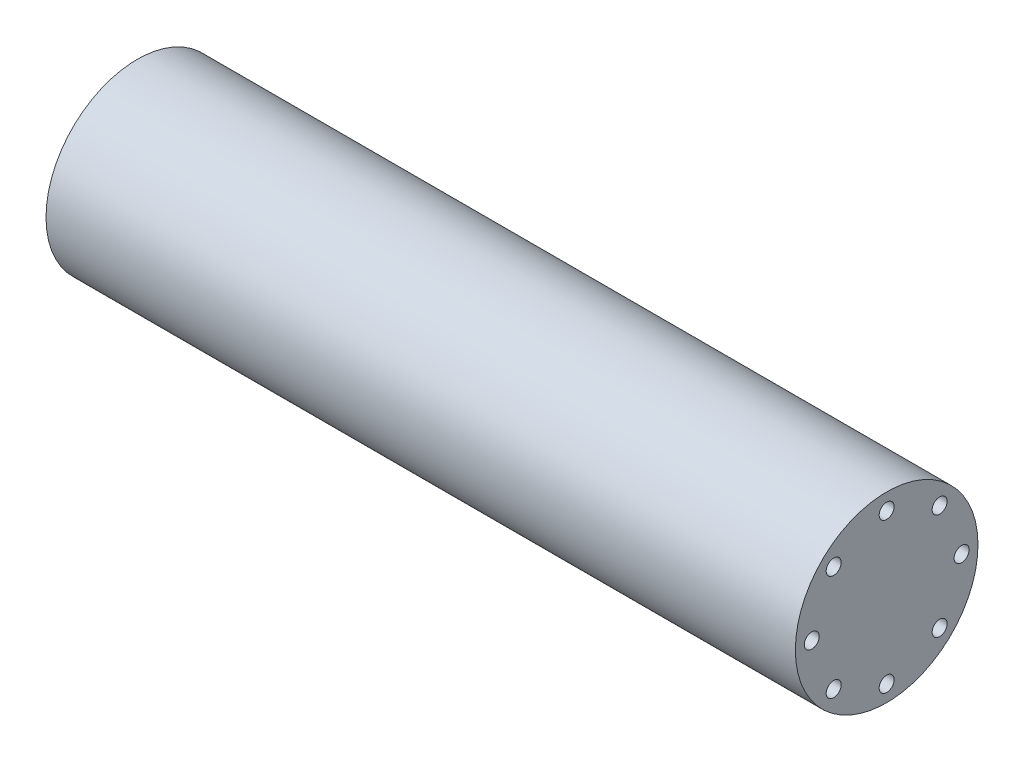
ISO-10303-21;
HEADER;
FILE_DESCRIPTION(('STEP AP214'),'2;1');
FILE_NAME('part.step','',(''),(''),'','','');
FILE_SCHEMA(('AUTOMOTIVE_DESIGN { 1 0 10303 214 1 1 1 1 }'));
ENDSEC;
DATA;
#1=APPLICATION_CONTEXT('core data for automotive mechanical design processes');
#2=APPLICATION_PROTOCOL_DEFINITION('international standard','automotive_design',2000,#1);
#3=PRODUCT_CONTEXT('',#1,'mechanical');
#4=PRODUCT('Part','Part','',(#3));
#5=PRODUCT_RELATED_PRODUCT_CATEGORY('part','',(#4));
#6=PRODUCT_DEFINITION_FORMATION('','',#4);
#7=PRODUCT_DEFINITION_CONTEXT('part definition',#1,'design');
#8=PRODUCT_DEFINITION('design','',#6,#7);
#9=PRODUCT_DEFINITION_SHAPE('','',#8);
#10=(LENGTH_UNIT() NAMED_UNIT(*) SI_UNIT(.MILLI.,.METRE.));
#11=(NAMED_UNIT(*) PLANE_ANGLE_UNIT() SI_UNIT($,.RADIAN.));
#12=(NAMED_UNIT(*) SI_UNIT($,.STERADIAN.) SOLID_ANGLE_UNIT());
#13=UNCERTAINTY_MEASURE_WITH_UNIT(LENGTH_MEASURE(1.E-05),#10,'distance_accuracy_value','');
#14=(GEOMETRIC_REPRESENTATION_CONTEXT(3) GLOBAL_UNCERTAINTY_ASSIGNED_CONTEXT((#13)) GLOBAL_UNIT_ASSIGNED_CONTEXT((#10,
#11,#12)) REPRESENTATION_CONTEXT('',''));
#15=CARTESIAN_POINT('',(0.,0.,0.));
#16=DIRECTION('',(0.,0.,1.));
#17=DIRECTION('',(1.,0.,0.));
#18=AXIS2_PLACEMENT_3D('',#15,#16,#17);
#19=CARTESIAN_POINT('',(80.,0.,0.));
#20=DIRECTION('',(-1.,0.,0.));
#21=DIRECTION('',(0.,0.,1.));
#22=AXIS2_PLACEMENT_3D('',#19,#20,#21);
#23=CYLINDRICAL_SURFACE('',#22,9.75);
#24=CARTESIAN_POINT('',(80.,0.,0.));
#25=DIRECTION('',(-1.,0.,0.));
#26=DIRECTION('',(0.,0.,1.));
#27=AXIS2_PLACEMENT_3D('',#24,#25,#26);
#28=CIRCLE('',#27,9.75);
#29=CARTESIAN_POINT('',(80.,0.,9.75));
#30=VERTEX_POINT('',#29);
#31=EDGE_CURVE('E11',#30,#30,#28,.T.);
#32=ORIENTED_EDGE('',*,*,#31,.T.);
#33=EDGE_LOOP('',(#32));
#34=FACE_BOUND('',#33,.T.);
#35=CARTESIAN_POINT('',(0.,0.,0.));
#36=DIRECTION('',(-1.,0.,0.));
#37=DIRECTION('',(0.,0.,1.));
#38=AXIS2_PLACEMENT_3D('',#35,#36,#37);
#39=CIRCLE('',#38,9.75);
#40=CARTESIAN_POINT('',(0.,0.,9.75));
#41=VERTEX_POINT('',#40);
#42=EDGE_CURVE('E40',#41,#41,#39,.T.);
#43=ORIENTED_EDGE('',*,*,#42,.F.);
#44=EDGE_LOOP('',(#43));
#45=FACE_BOUND('',#44,.T.);
#46=ADVANCED_FACE('F33',(#34,#45),#23,.T.);
#47=CARTESIAN_POINT('',(80.,9.75,0.));
#48=DIRECTION('',(1.,0.,0.));
#49=DIRECTION('',(0.,0.,-1.));
#50=AXIS2_PLACEMENT_3D('',#47,#48,#49);
#51=PLANE('',#50);
#52=CARTESIAN_POINT('',(80.,8.,0.));
#53=DIRECTION('',(1.,0.,0.));
#54=DIRECTION('',(0.,0.,-1.));
#55=AXIS2_PLACEMENT_3D('',#52,#53,#54);
#56=CIRCLE('',#55,0.799999999999986);
#57=CARTESIAN_POINT('',(80.,8.,-0.799999999999986));
#58=VERTEX_POINT('',#57);
#59=EDGE_CURVE('E100',#58,#58,#56,.T.);
#60=ORIENTED_EDGE('',*,*,#59,.F.);
#61=EDGE_LOOP('',(#60));
#62=FACE_BOUND('',#61,.T.);
#63=CARTESIAN_POINT('',(80.,5.65685424949262,-5.65685424949248));
#64=DIRECTION('',(1.,0.,0.));
#65=DIRECTION('',(0.,0.,-1.));
#66=AXIS2_PLACEMENT_3D('',#63,#64,#65);
#67=CIRCLE('',#66,0.799999999999986);
#68=CARTESIAN_POINT('',(80.,5.65685424949262,-6.45685424949247));
#69=VERTEX_POINT('',#68);
#70=EDGE_CURVE('E99',#69,#69,#67,.T.);
#71=ORIENTED_EDGE('',*,*,#70,.F.);
#72=EDGE_LOOP('',(#71));
#73=FACE_BOUND('',#72,.T.);
#74=CARTESIAN_POINT('',(80.,3.4008079572553E-13,-8.00000000000034));
#75=DIRECTION('',(1.,0.,0.));
#76=DIRECTION('',(0.,0.,-1.));
#77=AXIS2_PLACEMENT_3D('',#74,#75,#76);
#78=CIRCLE('',#77,0.799999999999986);
#79=CARTESIAN_POINT('',(80.,3.4008079572553E-13,-8.80000000000033));
#80=VERTEX_POINT('',#79);
#81=EDGE_CURVE('E110',#80,#80,#78,.T.);
#82=ORIENTED_EDGE('',*,*,#81,.F.);
#83=EDGE_LOOP('',(#82));
#84=FACE_BOUND('',#83,.T.);
#85=CARTESIAN_POINT('',(80.,-5.65685424949214,-5.65685424949296));
#86=DIRECTION('',(1.,0.,0.));
#87=DIRECTION('',(0.,0.,-1.));
#88=AXIS2_PLACEMENT_3D('',#85,#86,#87);
#89=CIRCLE('',#88,0.799999999999986);
#90=CARTESIAN_POINT('',(80.,-5.65685424949214,-6.45685424949295));
#91=VERTEX_POINT('',#90);
#92=EDGE_CURVE('E116',#91,#91,#89,.T.);
#93=ORIENTED_EDGE('',*,*,#92,.F.);
#94=EDGE_LOOP('',(#93));
#95=FACE_BOUND('',#94,.T.);
#96=CARTESIAN_POINT('',(80.,-8.,-6.8016159145106E-13));
#97=DIRECTION('',(1.,0.,0.));
#98=DIRECTION('',(0.,0.,-1.));
#99=AXIS2_PLACEMENT_3D('',#96,#97,#98);
#100=CIRCLE('',#99,0.799999999999986);
#101=CARTESIAN_POINT('',(80.,-8.,-0.800000000000667));
#102=VERTEX_POINT('',#101);
#103=EDGE_CURVE('E122',#102,#102,#100,.T.);
#104=ORIENTED_EDGE('',*,*,#103,.F.);
#105=EDGE_LOOP('',(#104));
#106=FACE_BOUND('',#105,.T.);
#107=CARTESIAN_POINT('',(80.,-5.65685424949262,5.6568542494918));
#108=DIRECTION('',(1.,0.,0.));
#109=DIRECTION('',(0.,0.,-1.));
#110=AXIS2_PLACEMENT_3D('',#107,#108,#109);
#111=CIRCLE('',#110,0.799999999999986);
#112=CARTESIAN_POINT('',(80.,-5.65685424949262,4.85685424949181));
#113=VERTEX_POINT('',#112);
#114=EDGE_CURVE('E128',#113,#113,#111,.T.);
#115=ORIENTED_EDGE('',*,*,#114,.F.);
#116=EDGE_LOOP('',(#115));
#117=FACE_BOUND('',#116,.T.);
#118=CARTESIAN_POINT('',(80.,-3.41060513164848E-13,7.99999999999966));
#119=DIRECTION('',(1.,0.,0.));
#120=DIRECTION('',(0.,0.,-1.));
#121=AXIS2_PLACEMENT_3D('',#118,#119,#120);
#122=CIRCLE('',#121,0.799999999999986);
#123=CARTESIAN_POINT('',(80.,-3.41060513164848E-13,7.19999999999967));
#124=VERTEX_POINT('',#123);
#125=EDGE_CURVE('E134',#124,#124,#122,.T.);
#126=ORIENTED_EDGE('',*,*,#125,.F.);
#127=EDGE_LOOP('',(#126));
#128=FACE_BOUND('',#127,.T.);
#129=CARTESIAN_POINT('',(80.,5.65685424949214,5.65685424949228));
#130=DIRECTION('',(1.,0.,0.));
#131=DIRECTION('',(0.,0.,-1.));
#132=AXIS2_PLACEMENT_3D('',#129,#130,#131);
#133=CIRCLE('',#132,0.799999999999986);
#134=CARTESIAN_POINT('',(80.,5.65685424949214,4.85685424949229));
#135=VERTEX_POINT('',#134);
#136=EDGE_CURVE('E140',#135,#135,#133,.T.);
#137=ORIENTED_EDGE('',*,*,#136,.F.);
#138=EDGE_LOOP('',(#137));
#139=FACE_BOUND('',#138,.T.);
#140=ORIENTED_EDGE('',*,*,#31,.F.);
#141=EDGE_LOOP('',(#140));
#142=FACE_BOUND('',#141,.T.);
#143=ADVANCED_FACE('F199',(#62,#73,#84,#95,#106,#117,#128,#139,#142),#51,.T.);
#144=CARTESIAN_POINT('',(0.,0.,0.));
#145=DIRECTION('',(-1.,0.,0.));
#146=DIRECTION('',(0.,0.,1.));
#147=AXIS2_PLACEMENT_3D('',#144,#145,#146);
#148=PLANE('',#147);
#149=CARTESIAN_POINT('',(0.,8.,0.));
#150=DIRECTION('',(-1.,0.,0.));
#151=DIRECTION('',(0.,0.,1.));
#152=AXIS2_PLACEMENT_3D('',#149,#150,#151);
#153=CIRCLE('',#152,0.799999999999986);
#154=CARTESIAN_POINT('',(0.,8.,0.799999999999986));
#155=VERTEX_POINT('',#154);
#156=EDGE_CURVE('E146',#155,#155,#153,.T.);
#157=ORIENTED_EDGE('',*,*,#156,.F.);
#158=EDGE_LOOP('',(#157));
#159=FACE_BOUND('',#158,.T.);
#160=CARTESIAN_POINT('',(0.,5.65685424949262,-5.65685424949248));
#161=DIRECTION('',(-1.,0.,0.));
#162=DIRECTION('',(0.,0.,1.));
#163=AXIS2_PLACEMENT_3D('',#160,#161,#162);
#164=CIRCLE('',#163,0.799999999999986);
#165=CARTESIAN_POINT('',(0.,5.65685424949262,-4.85685424949249));
#166=VERTEX_POINT('',#165);
#167=EDGE_CURVE('E152',#166,#166,#164,.T.);
#168=ORIENTED_EDGE('',*,*,#167,.F.);
#169=EDGE_LOOP('',(#168));
#170=FACE_BOUND('',#169,.T.);
#171=CARTESIAN_POINT('',(0.,3.4008079572553E-13,-8.00000000000034));
#172=DIRECTION('',(-1.,0.,0.));
#173=DIRECTION('',(0.,0.,1.));
#174=AXIS2_PLACEMENT_3D('',#171,#172,#173);
#175=CIRCLE('',#174,0.799999999999986);
#176=CARTESIAN_POINT('',(0.,3.4008079572553E-13,-7.20000000000036));
#177=VERTEX_POINT('',#176);
#178=EDGE_CURVE('E158',#177,#177,#175,.T.);
#179=ORIENTED_EDGE('',*,*,#178,.F.);
#180=EDGE_LOOP('',(#179));
#181=FACE_BOUND('',#180,.T.);
#182=CARTESIAN_POINT('',(0.,-5.65685424949214,-5.65685424949296));
#183=DIRECTION('',(-1.,0.,0.));
#184=DIRECTION('',(0.,0.,1.));
#185=AXIS2_PLACEMENT_3D('',#182,#183,#184);
#186=CIRCLE('',#185,0.799999999999986);
#187=CARTESIAN_POINT('',(0.,-5.65685424949214,-4.85685424949297));
#188=VERTEX_POINT('',#187);
#189=EDGE_CURVE('E164',#188,#188,#186,.T.);
#190=ORIENTED_EDGE('',*,*,#189,.F.);
#191=EDGE_LOOP('',(#190));
#192=FACE_BOUND('',#191,.T.);
#193=CARTESIAN_POINT('',(0.,-8.,-6.8016159145106E-13));
#194=DIRECTION('',(-1.,0.,0.));
#195=DIRECTION('',(0.,0.,1.));
#196=AXIS2_PLACEMENT_3D('',#193,#194,#195);
#197=CIRCLE('',#196,0.799999999999986);
#198=CARTESIAN_POINT('',(0.,-8.,0.799999999999306));
#199=VERTEX_POINT('',#198);
#200=EDGE_CURVE('E170',#199,#199,#197,.T.);
#201=ORIENTED_EDGE('',*,*,#200,.F.);
#202=EDGE_LOOP('',(#201));
#203=FACE_BOUND('',#202,.T.);
#204=CARTESIAN_POINT('',(0.,-5.65685424949262,5.6568542494918));
#205=DIRECTION('',(-1.,0.,0.));
#206=DIRECTION('',(0.,0.,1.));
#207=AXIS2_PLACEMENT_3D('',#204,#205,#206);
#208=CIRCLE('',#207,0.799999999999986);
#209=CARTESIAN_POINT('',(0.,-5.65685424949262,6.45685424949179));
#210=VERTEX_POINT('',#209);
#211=EDGE_CURVE('E176',#210,#210,#208,.T.);
#212=ORIENTED_EDGE('',*,*,#211,.F.);
#213=EDGE_LOOP('',(#212));
#214=FACE_BOUND('',#213,.T.);
#215=CARTESIAN_POINT('',(0.,-3.41060513164848E-13,7.99999999999966));
#216=DIRECTION('',(-1.,0.,0.));
#217=DIRECTION('',(0.,0.,1.));
#218=AXIS2_PLACEMENT_3D('',#215,#216,#217);
#219=CIRCLE('',#218,0.799999999999986);
#220=CARTESIAN_POINT('',(0.,-3.41060513164848E-13,8.79999999999965));
#221=VERTEX_POINT('',#220);
#222=EDGE_CURVE('E182',#221,#221,#219,.T.);
#223=ORIENTED_EDGE('',*,*,#222,.F.);
#224=EDGE_LOOP('',(#223));
#225=FACE_BOUND('',#224,.T.);
#226=CARTESIAN_POINT('',(0.,5.65685424949214,5.65685424949228));
#227=DIRECTION('',(-1.,0.,0.));
#228=DIRECTION('',(0.,0.,1.));
#229=AXIS2_PLACEMENT_3D('',#226,#227,#228);
#230=CIRCLE('',#229,0.799999999999986);
#231=CARTESIAN_POINT('',(0.,5.65685424949214,6.45685424949227));
#232=VERTEX_POINT('',#231);
#233=EDGE_CURVE('E188',#232,#232,#230,.T.);
#234=ORIENTED_EDGE('',*,*,#233,.F.);
#235=EDGE_LOOP('',(#234));
#236=FACE_BOUND('',#235,.T.);
#237=ORIENTED_EDGE('',*,*,#42,.T.);
#238=EDGE_LOOP('',(#237));
#239=FACE_BOUND('',#238,.T.);
#240=ADVANCED_FACE('F196',(#159,#170,#181,#192,#203,#214,#225,#236,#239),#148,.T.);
#241=CARTESIAN_POINT('',(15.2,5.65685424949214,5.65685424949228));
#242=DIRECTION('',(-1.,0.,0.));
#243=DIRECTION('',(0.,0.,1.));
#244=AXIS2_PLACEMENT_3D('',#241,#242,#243);
#245=CONICAL_SURFACE('',#244,0.799999999999985,1.02974425859498);
#246=CARTESIAN_POINT('',(15.680688495311,5.65685424949214,5.65685424949228));
#247=VERTEX_POINT('',#246);
#248=VERTEX_LOOP('',#247);
#249=FACE_BOUND('',#248,.T.);
#250=CARTESIAN_POINT('',(15.2,5.65685424949214,5.65685424949228));
#251=DIRECTION('',(-1.,0.,0.));
#252=DIRECTION('',(0.,0.,1.));
#253=AXIS2_PLACEMENT_3D('',#250,#251,#252);
#254=CIRCLE('',#253,0.799999999999985);
#255=CARTESIAN_POINT('',(15.2,5.65685424949214,6.45685424949227));
#256=VERTEX_POINT('',#255);
#257=EDGE_CURVE('E191',#256,#256,#254,.T.);
#258=ORIENTED_EDGE('',*,*,#257,.T.);
#259=EDGE_LOOP('',(#258));
#260=FACE_BOUND('',#259,.T.);
#261=ADVANCED_FACE('F210',(#249,#260),#245,.F.);
#262=CARTESIAN_POINT('',(0.,5.65685424949214,5.65685424949228));
#263=DIRECTION('',(-1.,0.,0.));
#264=DIRECTION('',(0.,0.,1.));
#265=AXIS2_PLACEMENT_3D('',#262,#263,#264);
#266=CYLINDRICAL_SURFACE('',#265,0.799999999999986);
#267=ORIENTED_EDGE('',*,*,#257,.F.);
#268=EDGE_LOOP('',(#267));
#269=FACE_BOUND('',#268,.T.);
#270=ORIENTED_EDGE('',*,*,#233,.T.);
#271=EDGE_LOOP('',(#270));
#272=FACE_BOUND('',#271,.T.);
#273=ADVANCED_FACE('F218',(#269,#272),#266,.F.);
#274=CARTESIAN_POINT('',(15.2,-3.41060513164848E-13,7.99999999999966));
#275=DIRECTION('',(-1.,0.,0.));
#276=DIRECTION('',(0.,0.,1.));
#277=AXIS2_PLACEMENT_3D('',#274,#275,#276);
#278=CONICAL_SURFACE('',#277,0.799999999999985,1.02974425859498);
#279=CARTESIAN_POINT('',(15.680688495311,-3.45106817684485E-13,7.99999999999966));
#280=VERTEX_POINT('',#279);
#281=VERTEX_LOOP('',#280);
#282=FACE_BOUND('',#281,.T.);
#283=CARTESIAN_POINT('',(15.2,-3.41060513164848E-13,7.99999999999966));
#284=DIRECTION('',(-1.,0.,0.));
#285=DIRECTION('',(0.,0.,1.));
#286=AXIS2_PLACEMENT_3D('',#283,#284,#285);
#287=CIRCLE('',#286,0.799999999999985);
#288=CARTESIAN_POINT('',(15.2,-3.41060513164848E-13,8.79999999999965));
#289=VERTEX_POINT('',#288);
#290=EDGE_CURVE('E185',#289,#289,#287,.T.);
#291=ORIENTED_EDGE('',*,*,#290,.T.);
#292=EDGE_LOOP('',(#291));
#293=FACE_BOUND('',#292,.T.);
#294=ADVANCED_FACE('F221',(#282,#293),#278,.F.);
#295=CARTESIAN_POINT('',(0.,-3.41060513164848E-13,7.99999999999966));
#296=DIRECTION('',(-1.,0.,0.));
#297=DIRECTION('',(0.,0.,1.));
#298=AXIS2_PLACEMENT_3D('',#295,#296,#297);
#299=CYLINDRICAL_SURFACE('',#298,0.799999999999986);
#300=ORIENTED_EDGE('',*,*,#290,.F.);
#301=EDGE_LOOP('',(#300));
#302=FACE_BOUND('',#301,.T.);
#303=ORIENTED_EDGE('',*,*,#222,.T.);
#304=EDGE_LOOP('',(#303));
#305=FACE_BOUND('',#304,.T.);
#306=ADVANCED_FACE('F225',(#302,#305),#299,.F.);
#307=CARTESIAN_POINT('',(15.2,-5.65685424949262,5.6568542494918));
#308=DIRECTION('',(-1.,0.,0.));
#309=DIRECTION('',(0.,0.,1.));
#310=AXIS2_PLACEMENT_3D('',#307,#308,#309);
#311=CONICAL_SURFACE('',#310,0.799999999999985,1.02974425859498);
#312=CARTESIAN_POINT('',(15.680688495311,-5.65685424949263,5.6568542494918));
#313=VERTEX_POINT('',#312);
#314=VERTEX_LOOP('',#313);
#315=FACE_BOUND('',#314,.T.);
#316=CARTESIAN_POINT('',(15.2,-5.65685424949262,5.6568542494918));
#317=DIRECTION('',(-1.,0.,0.));
#318=DIRECTION('',(0.,0.,1.));
#319=AXIS2_PLACEMENT_3D('',#316,#317,#318);
#320=CIRCLE('',#319,0.799999999999985);
#321=CARTESIAN_POINT('',(15.2,-5.65685424949262,6.45685424949179));
#322=VERTEX_POINT('',#321);
#323=EDGE_CURVE('E179',#322,#322,#320,.T.);
#324=ORIENTED_EDGE('',*,*,#323,.T.);
#325=EDGE_LOOP('',(#324));
#326=FACE_BOUND('',#325,.T.);
#327=ADVANCED_FACE('F228',(#315,#326),#311,.F.);
#328=CARTESIAN_POINT('',(0.,-5.65685424949262,5.6568542494918));
#329=DIRECTION('',(-1.,0.,0.));
#330=DIRECTION('',(0.,0.,1.));
#331=AXIS2_PLACEMENT_3D('',#328,#329,#330);
#332=CYLINDRICAL_SURFACE('',#331,0.799999999999986);
#333=ORIENTED_EDGE('',*,*,#323,.F.);
#334=EDGE_LOOP('',(#333));
#335=FACE_BOUND('',#334,.T.);
#336=ORIENTED_EDGE('',*,*,#211,.T.);
#337=EDGE_LOOP('',(#336));
#338=FACE_BOUND('',#337,.T.);
#339=ADVANCED_FACE('F232',(#335,#338),#332,.F.);
#340=CARTESIAN_POINT('',(15.2,-8.,-6.8016159145106E-13));
#341=DIRECTION('',(-1.,0.,0.));
#342=DIRECTION('',(0.,0.,1.));
#343=AXIS2_PLACEMENT_3D('',#340,#341,#342);
#344=CONICAL_SURFACE('',#343,0.799999999999985,1.02974425859498);
#345=CARTESIAN_POINT('',(15.680688495311,-8.,-6.8016159145106E-13));
#346=VERTEX_POINT('',#345);
#347=VERTEX_LOOP('',#346);
#348=FACE_BOUND('',#347,.T.);
#349=CARTESIAN_POINT('',(15.2,-8.,-6.8016159145106E-13));
#350=DIRECTION('',(-1.,0.,0.));
#351=DIRECTION('',(0.,0.,1.));
#352=AXIS2_PLACEMENT_3D('',#349,#350,#351);
#353=CIRCLE('',#352,0.799999999999985);
#354=CARTESIAN_POINT('',(15.2,-8.,0.799999999999305));
#355=VERTEX_POINT('',#354);
#356=EDGE_CURVE('E173',#355,#355,#353,.T.);
#357=ORIENTED_EDGE('',*,*,#356,.T.);
#358=EDGE_LOOP('',(#357));
#359=FACE_BOUND('',#358,.T.);
#360=ADVANCED_FACE('F236',(#348,#359),#344,.F.);
#361=CARTESIAN_POINT('',(0.,-8.,-6.8016159145106E-13));
#362=DIRECTION('',(-1.,0.,0.));
#363=DIRECTION('',(0.,0.,1.));
#364=AXIS2_PLACEMENT_3D('',#361,#362,#363);
#365=CYLINDRICAL_SURFACE('',#364,0.799999999999986);
#366=ORIENTED_EDGE('',*,*,#356,.F.);
#367=EDGE_LOOP('',(#366));
#368=FACE_BOUND('',#367,.T.);
#369=ORIENTED_EDGE('',*,*,#200,.T.);
#370=EDGE_LOOP('',(#369));
#371=FACE_BOUND('',#370,.T.);
#372=ADVANCED_FACE('F240',(#368,#371),#365,.F.);
#373=CARTESIAN_POINT('',(15.2,-5.65685424949214,-5.65685424949296));
#374=DIRECTION('',(-1.,0.,0.));
#375=DIRECTION('',(0.,0.,1.));
#376=AXIS2_PLACEMENT_3D('',#373,#374,#375);
#377=CONICAL_SURFACE('',#376,0.799999999999985,1.02974425859498);
#378=CARTESIAN_POINT('',(15.680688495311,-5.65685424949214,-5.65685424949296));
#379=VERTEX_POINT('',#378);
#380=VERTEX_LOOP('',#379);
#381=FACE_BOUND('',#380,.T.);
#382=CARTESIAN_POINT('',(15.2,-5.65685424949214,-5.65685424949296));
#383=DIRECTION('',(-1.,0.,0.));
#384=DIRECTION('',(0.,0.,1.));
#385=AXIS2_PLACEMENT_3D('',#382,#383,#384);
#386=CIRCLE('',#385,0.799999999999985);
#387=CARTESIAN_POINT('',(15.2,-5.65685424949214,-4.85685424949298));
#388=VERTEX_POINT('',#387);
#389=EDGE_CURVE('E167',#388,#388,#386,.T.);
#390=ORIENTED_EDGE('',*,*,#389,.T.);
#391=EDGE_LOOP('',(#390));
#392=FACE_BOUND('',#391,.T.);
#393=ADVANCED_FACE('F244',(#381,#392),#377,.F.);
#394=CARTESIAN_POINT('',(0.,-5.65685424949214,-5.65685424949296));
#395=DIRECTION('',(-1.,0.,0.));
#396=DIRECTION('',(0.,0.,1.));
#397=AXIS2_PLACEMENT_3D('',#394,#395,#396);
#398=CYLINDRICAL_SURFACE('',#397,0.799999999999986);
#399=ORIENTED_EDGE('',*,*,#389,.F.);
#400=EDGE_LOOP('',(#399));
#401=FACE_BOUND('',#400,.T.);
#402=ORIENTED_EDGE('',*,*,#189,.T.);
#403=EDGE_LOOP('',(#402));
#404=FACE_BOUND('',#403,.T.);
#405=ADVANCED_FACE('F248',(#401,#404),#398,.F.);
#406=CARTESIAN_POINT('',(15.2,3.4008079572553E-13,-8.00000000000034));
#407=DIRECTION('',(-1.,0.,0.));
#408=DIRECTION('',(0.,0.,1.));
#409=AXIS2_PLACEMENT_3D('',#406,#407,#408);
#410=CONICAL_SURFACE('',#409,0.799999999999985,1.02974425859498);
#411=CARTESIAN_POINT('',(15.680688495311,3.36034491205893E-13,-8.00000000000034));
#412=VERTEX_POINT('',#411);
#413=VERTEX_LOOP('',#412);
#414=FACE_BOUND('',#413,.T.);
#415=CARTESIAN_POINT('',(15.2,3.4008079572553E-13,-8.00000000000034));
#416=DIRECTION('',(-1.,0.,0.));
#417=DIRECTION('',(0.,0.,1.));
#418=AXIS2_PLACEMENT_3D('',#415,#416,#417);
#419=CIRCLE('',#418,0.799999999999985);
#420=CARTESIAN_POINT('',(15.2,3.4008079572553E-13,-7.20000000000036));
#421=VERTEX_POINT('',#420);
#422=EDGE_CURVE('E161',#421,#421,#419,.T.);
#423=ORIENTED_EDGE('',*,*,#422,.T.);
#424=EDGE_LOOP('',(#423));
#425=FACE_BOUND('',#424,.T.);
#426=ADVANCED_FACE('F252',(#414,#425),#410,.F.);
#427=CARTESIAN_POINT('',(0.,3.4008079572553E-13,-8.00000000000034));
#428=DIRECTION('',(-1.,0.,0.));
#429=DIRECTION('',(0.,0.,1.));
#430=AXIS2_PLACEMENT_3D('',#427,#428,#429);
#431=CYLINDRICAL_SURFACE('',#430,0.799999999999986);
#432=ORIENTED_EDGE('',*,*,#422,.F.);
#433=EDGE_LOOP('',(#432));
#434=FACE_BOUND('',#433,.T.);
#435=ORIENTED_EDGE('',*,*,#178,.T.);
#436=EDGE_LOOP('',(#435));
#437=FACE_BOUND('',#436,.T.);
#438=ADVANCED_FACE('F256',(#434,#437),#431,.F.);
#439=CARTESIAN_POINT('',(15.2,5.65685424949262,-5.65685424949248));
#440=DIRECTION('',(-1.,0.,0.));
#441=DIRECTION('',(0.,0.,1.));
#442=AXIS2_PLACEMENT_3D('',#439,#440,#441);
#443=CONICAL_SURFACE('',#442,0.799999999999985,1.02974425859498);
#444=CARTESIAN_POINT('',(15.680688495311,5.65685424949262,-5.65685424949248));
#445=VERTEX_POINT('',#444);
#446=VERTEX_LOOP('',#445);
#447=FACE_BOUND('',#446,.T.);
#448=CARTESIAN_POINT('',(15.2,5.65685424949262,-5.65685424949248));
#449=DIRECTION('',(-1.,0.,0.));
#450=DIRECTION('',(0.,0.,1.));
#451=AXIS2_PLACEMENT_3D('',#448,#449,#450);
#452=CIRCLE('',#451,0.799999999999985);
#453=CARTESIAN_POINT('',(15.2,5.65685424949262,-4.8568542494925));
#454=VERTEX_POINT('',#453);
#455=EDGE_CURVE('E155',#454,#454,#452,.T.);
#456=ORIENTED_EDGE('',*,*,#455,.T.);
#457=EDGE_LOOP('',(#456));
#458=FACE_BOUND('',#457,.T.);
#459=ADVANCED_FACE('F260',(#447,#458),#443,.F.);
#460=CARTESIAN_POINT('',(0.,5.65685424949262,-5.65685424949248));
#461=DIRECTION('',(-1.,0.,0.));
#462=DIRECTION('',(0.,0.,1.));
#463=AXIS2_PLACEMENT_3D('',#460,#461,#462);
#464=CYLINDRICAL_SURFACE('',#463,0.799999999999986);
#465=ORIENTED_EDGE('',*,*,#455,.F.);
#466=EDGE_LOOP('',(#465));
#467=FACE_BOUND('',#466,.T.);
#468=ORIENTED_EDGE('',*,*,#167,.T.);
#469=EDGE_LOOP('',(#468));
#470=FACE_BOUND('',#469,.T.);
#471=ADVANCED_FACE('F264',(#467,#470),#464,.F.);
#472=CARTESIAN_POINT('',(15.2,8.,0.));
#473=DIRECTION('',(-1.,0.,0.));
#474=DIRECTION('',(0.,0.,1.));
#475=AXIS2_PLACEMENT_3D('',#472,#473,#474);
#476=CONICAL_SURFACE('',#475,0.799999999999985,1.02974425859498);
#477=CARTESIAN_POINT('',(15.680688495311,8.,0.));
#478=VERTEX_POINT('',#477);
#479=VERTEX_LOOP('',#478);
#480=FACE_BOUND('',#479,.T.);
#481=CARTESIAN_POINT('',(15.2,8.,0.));
#482=DIRECTION('',(-1.,0.,0.));
#483=DIRECTION('',(0.,0.,1.));
#484=AXIS2_PLACEMENT_3D('',#481,#482,#483);
#485=CIRCLE('',#484,0.799999999999985);
#486=CARTESIAN_POINT('',(15.2,8.,0.799999999999985));
#487=VERTEX_POINT('',#486);
#488=EDGE_CURVE('E149',#487,#487,#485,.T.);
#489=ORIENTED_EDGE('',*,*,#488,.T.);
#490=EDGE_LOOP('',(#489));
#491=FACE_BOUND('',#490,.T.);
#492=ADVANCED_FACE('F268',(#480,#491),#476,.F.);
#493=CARTESIAN_POINT('',(0.,8.,0.));
#494=DIRECTION('',(-1.,0.,0.));
#495=DIRECTION('',(0.,0.,1.));
#496=AXIS2_PLACEMENT_3D('',#493,#494,#495);
#497=CYLINDRICAL_SURFACE('',#496,0.799999999999986);
#498=ORIENTED_EDGE('',*,*,#488,.F.);
#499=EDGE_LOOP('',(#498));
#500=FACE_BOUND('',#499,.T.);
#501=ORIENTED_EDGE('',*,*,#156,.T.);
#502=EDGE_LOOP('',(#501));
#503=FACE_BOUND('',#502,.T.);
#504=ADVANCED_FACE('F272',(#500,#503),#497,.F.);
#505=CARTESIAN_POINT('',(64.8,5.65685424949214,5.65685424949228));
#506=DIRECTION('',(1.,0.,0.));
#507=DIRECTION('',(0.,0.,-1.));
#508=AXIS2_PLACEMENT_3D('',#505,#506,#507);
#509=CONICAL_SURFACE('',#508,0.799999999999985,1.02974425829183);
#510=CARTESIAN_POINT('',(64.319311504359,5.65685424949214,5.65685424949228));
#511=VERTEX_POINT('',#510);
#512=VERTEX_LOOP('',#511);
#513=FACE_BOUND('',#512,.T.);
#514=CARTESIAN_POINT('',(64.8,5.65685424949214,5.65685424949228));
#515=DIRECTION('',(1.,0.,0.));
#516=DIRECTION('',(0.,0.,-1.));
#517=AXIS2_PLACEMENT_3D('',#514,#515,#516);
#518=CIRCLE('',#517,0.799999999999985);
#519=CARTESIAN_POINT('',(64.8,5.65685424949214,4.8568542494923));
#520=VERTEX_POINT('',#519);
#521=EDGE_CURVE('E143',#520,#520,#518,.T.);
#522=ORIENTED_EDGE('',*,*,#521,.T.);
#523=EDGE_LOOP('',(#522));
#524=FACE_BOUND('',#523,.T.);
#525=ADVANCED_FACE('F276',(#513,#524),#509,.F.);
#526=CARTESIAN_POINT('',(80.,5.65685424949214,5.65685424949228));
#527=DIRECTION('',(1.,0.,0.));
#528=DIRECTION('',(0.,0.,-1.));
#529=AXIS2_PLACEMENT_3D('',#526,#527,#528);
#530=CYLINDRICAL_SURFACE('',#529,0.799999999999986);
#531=ORIENTED_EDGE('',*,*,#521,.F.);
#532=EDGE_LOOP('',(#531));
#533=FACE_BOUND('',#532,.T.);
#534=ORIENTED_EDGE('',*,*,#136,.T.);
#535=EDGE_LOOP('',(#534));
#536=FACE_BOUND('',#535,.T.);
#537=ADVANCED_FACE('F280',(#533,#536),#530,.F.);
#538=CARTESIAN_POINT('',(64.8,-3.41060513164848E-13,7.99999999999966));
#539=DIRECTION('',(1.,0.,0.));
#540=DIRECTION('',(0.,0.,-1.));
#541=AXIS2_PLACEMENT_3D('',#538,#539,#540);
#542=CONICAL_SURFACE('',#541,0.799999999999985,1.02974425829183);
#543=CARTESIAN_POINT('',(64.319311504359,-3.44154013714528E-13,7.99999999999966));
#544=VERTEX_POINT('',#543);
#545=VERTEX_LOOP('',#544);
#546=FACE_BOUND('',#545,.T.);
#547=CARTESIAN_POINT('',(64.8,-3.41060513164848E-13,7.99999999999966));
#548=DIRECTION('',(1.,0.,0.));
#549=DIRECTION('',(0.,0.,-1.));
#550=AXIS2_PLACEMENT_3D('',#547,#548,#549);
#551=CIRCLE('',#550,0.799999999999985);
#552=CARTESIAN_POINT('',(64.8,-3.41060513164848E-13,7.19999999999968));
#553=VERTEX_POINT('',#552);
#554=EDGE_CURVE('E137',#553,#553,#551,.T.);
#555=ORIENTED_EDGE('',*,*,#554,.T.);
#556=EDGE_LOOP('',(#555));
#557=FACE_BOUND('',#556,.T.);
#558=ADVANCED_FACE('F284',(#546,#557),#542,.F.);
#559=CARTESIAN_POINT('',(80.,-3.41060513164848E-13,7.99999999999966));
#560=DIRECTION('',(1.,0.,0.));
#561=DIRECTION('',(0.,0.,-1.));
#562=AXIS2_PLACEMENT_3D('',#559,#560,#561);
#563=CYLINDRICAL_SURFACE('',#562,0.799999999999986);
#564=ORIENTED_EDGE('',*,*,#554,.F.);
#565=EDGE_LOOP('',(#564));
#566=FACE_BOUND('',#565,.T.);
#567=ORIENTED_EDGE('',*,*,#125,.T.);
#568=EDGE_LOOP('',(#567));
#569=FACE_BOUND('',#568,.T.);
#570=ADVANCED_FACE('F288',(#566,#569),#563,.F.);
#571=CARTESIAN_POINT('',(64.8,-5.65685424949262,5.6568542494918));
#572=DIRECTION('',(1.,0.,0.));
#573=DIRECTION('',(0.,0.,-1.));
#574=AXIS2_PLACEMENT_3D('',#571,#572,#573);
#575=CONICAL_SURFACE('',#574,0.799999999999985,1.02974425829183);
#576=CARTESIAN_POINT('',(64.319311504359,-5.65685424949263,5.6568542494918));
#577=VERTEX_POINT('',#576);
#578=VERTEX_LOOP('',#577);
#579=FACE_BOUND('',#578,.T.);
#580=CARTESIAN_POINT('',(64.8,-5.65685424949262,5.6568542494918));
#581=DIRECTION('',(1.,0.,0.));
#582=DIRECTION('',(0.,0.,-1.));
#583=AXIS2_PLACEMENT_3D('',#580,#581,#582);
#584=CIRCLE('',#583,0.799999999999985);
#585=CARTESIAN_POINT('',(64.8,-5.65685424949262,4.85685424949182));
#586=VERTEX_POINT('',#585);
#587=EDGE_CURVE('E131',#586,#586,#584,.T.);
#588=ORIENTED_EDGE('',*,*,#587,.T.);
#589=EDGE_LOOP('',(#588));
#590=FACE_BOUND('',#589,.T.);
#591=ADVANCED_FACE('F292',(#579,#590),#575,.F.);
#592=CARTESIAN_POINT('',(80.,-5.65685424949262,5.6568542494918));
#593=DIRECTION('',(1.,0.,0.));
#594=DIRECTION('',(0.,0.,-1.));
#595=AXIS2_PLACEMENT_3D('',#592,#593,#594);
#596=CYLINDRICAL_SURFACE('',#595,0.799999999999986);
#597=ORIENTED_EDGE('',*,*,#587,.F.);
#598=EDGE_LOOP('',(#597));
#599=FACE_BOUND('',#598,.T.);
#600=ORIENTED_EDGE('',*,*,#114,.T.);
#601=EDGE_LOOP('',(#600));
#602=FACE_BOUND('',#601,.T.);
#603=ADVANCED_FACE('F296',(#599,#602),#596,.F.);
#604=CARTESIAN_POINT('',(64.8,-8.,-6.8016159145106E-13));
#605=DIRECTION('',(1.,0.,0.));
#606=DIRECTION('',(0.,0.,-1.));
#607=AXIS2_PLACEMENT_3D('',#604,#605,#606);
#608=CONICAL_SURFACE('',#607,0.799999999999985,1.02974425829183);
#609=CARTESIAN_POINT('',(64.319311504359,-8.,-6.8016159145106E-13));
#610=VERTEX_POINT('',#609);
#611=VERTEX_LOOP('',#610);
#612=FACE_BOUND('',#611,.T.);
#613=CARTESIAN_POINT('',(64.8,-8.,-6.8016159145106E-13));
#614=DIRECTION('',(1.,0.,0.));
#615=DIRECTION('',(0.,0.,-1.));
#616=AXIS2_PLACEMENT_3D('',#613,#614,#615);
#617=CIRCLE('',#616,0.799999999999985);
#618=CARTESIAN_POINT('',(64.8,-8.,-0.800000000000665));
#619=VERTEX_POINT('',#618);
#620=EDGE_CURVE('E125',#619,#619,#617,.T.);
#621=ORIENTED_EDGE('',*,*,#620,.T.);
#622=EDGE_LOOP('',(#621));
#623=FACE_BOUND('',#622,.T.);
#624=ADVANCED_FACE('F300',(#612,#623),#608,.F.);
#625=CARTESIAN_POINT('',(80.,-8.,-6.8016159145106E-13));
#626=DIRECTION('',(1.,0.,0.));
#627=DIRECTION('',(0.,0.,-1.));
#628=AXIS2_PLACEMENT_3D('',#625,#626,#627);
#629=CYLINDRICAL_SURFACE('',#628,0.799999999999986);
#630=ORIENTED_EDGE('',*,*,#620,.F.);
#631=EDGE_LOOP('',(#630));
#632=FACE_BOUND('',#631,.T.);
#633=ORIENTED_EDGE('',*,*,#103,.T.);
#634=EDGE_LOOP('',(#633));
#635=FACE_BOUND('',#634,.T.);
#636=ADVANCED_FACE('F304',(#632,#635),#629,.F.);
#637=CARTESIAN_POINT('',(64.8,-5.65685424949214,-5.65685424949296));
#638=DIRECTION('',(1.,0.,0.));
#639=DIRECTION('',(0.,0.,-1.));
#640=AXIS2_PLACEMENT_3D('',#637,#638,#639);
#641=CONICAL_SURFACE('',#640,0.799999999999985,1.02974425829183);
#642=CARTESIAN_POINT('',(64.319311504359,-5.65685424949214,-5.65685424949296));
#643=VERTEX_POINT('',#642);
#644=VERTEX_LOOP('',#643);
#645=FACE_BOUND('',#644,.T.);
#646=CARTESIAN_POINT('',(64.8,-5.65685424949214,-5.65685424949296));
#647=DIRECTION('',(1.,0.,0.));
#648=DIRECTION('',(0.,0.,-1.));
#649=AXIS2_PLACEMENT_3D('',#646,#647,#648);
#650=CIRCLE('',#649,0.799999999999985);
#651=CARTESIAN_POINT('',(64.8,-5.65685424949214,-6.45685424949295));
#652=VERTEX_POINT('',#651);
#653=EDGE_CURVE('E119',#652,#652,#650,.T.);
#654=ORIENTED_EDGE('',*,*,#653,.T.);
#655=EDGE_LOOP('',(#654));
#656=FACE_BOUND('',#655,.T.);
#657=ADVANCED_FACE('F308',(#645,#656),#641,.F.);
#658=CARTESIAN_POINT('',(80.,-5.65685424949214,-5.65685424949296));
#659=DIRECTION('',(1.,0.,0.));
#660=DIRECTION('',(0.,0.,-1.));
#661=AXIS2_PLACEMENT_3D('',#658,#659,#660);
#662=CYLINDRICAL_SURFACE('',#661,0.799999999999986);
#663=ORIENTED_EDGE('',*,*,#653,.F.);
#664=EDGE_LOOP('',(#663));
#665=FACE_BOUND('',#664,.T.);
#666=ORIENTED_EDGE('',*,*,#92,.T.);
#667=EDGE_LOOP('',(#666));
#668=FACE_BOUND('',#667,.T.);
#669=ADVANCED_FACE('F312',(#665,#668),#662,.F.);
#670=CARTESIAN_POINT('',(64.8,3.4008079572553E-13,-8.00000000000034));
#671=DIRECTION('',(1.,0.,0.));
#672=DIRECTION('',(0.,0.,-1.));
#673=AXIS2_PLACEMENT_3D('',#670,#671,#672);
#674=CONICAL_SURFACE('',#673,0.799999999999985,1.02974425829183);
#675=CARTESIAN_POINT('',(64.319311504359,3.3698729517585E-13,-8.00000000000034));
#676=VERTEX_POINT('',#675);
#677=VERTEX_LOOP('',#676);
#678=FACE_BOUND('',#677,.T.);
#679=CARTESIAN_POINT('',(64.8,3.4008079572553E-13,-8.00000000000034));
#680=DIRECTION('',(1.,0.,0.));
#681=DIRECTION('',(0.,0.,-1.));
#682=AXIS2_PLACEMENT_3D('',#679,#680,#681);
#683=CIRCLE('',#682,0.799999999999985);
#684=CARTESIAN_POINT('',(64.8,3.4008079572553E-13,-8.80000000000033));
#685=VERTEX_POINT('',#684);
#686=EDGE_CURVE('E113',#685,#685,#683,.T.);
#687=ORIENTED_EDGE('',*,*,#686,.T.);
#688=EDGE_LOOP('',(#687));
#689=FACE_BOUND('',#688,.T.);
#690=ADVANCED_FACE('F316',(#678,#689),#674,.F.);
#691=CARTESIAN_POINT('',(80.,3.4008079572553E-13,-8.00000000000034));
#692=DIRECTION('',(1.,0.,0.));
#693=DIRECTION('',(0.,0.,-1.));
#694=AXIS2_PLACEMENT_3D('',#691,#692,#693);
#695=CYLINDRICAL_SURFACE('',#694,0.799999999999986);
#696=ORIENTED_EDGE('',*,*,#686,.F.);
#697=EDGE_LOOP('',(#696));
#698=FACE_BOUND('',#697,.T.);
#699=ORIENTED_EDGE('',*,*,#81,.T.);
#700=EDGE_LOOP('',(#699));
#701=FACE_BOUND('',#700,.T.);
#702=ADVANCED_FACE('F320',(#698,#701),#695,.F.);
#703=CARTESIAN_POINT('',(64.8,5.65685424949262,-5.65685424949248));
#704=DIRECTION('',(1.,0.,0.));
#705=DIRECTION('',(0.,0.,-1.));
#706=AXIS2_PLACEMENT_3D('',#703,#704,#705);
#707=CONICAL_SURFACE('',#706,0.799999999999985,1.02974425829183);
#708=CARTESIAN_POINT('',(64.319311504359,5.65685424949262,-5.65685424949248));
#709=VERTEX_POINT('',#708);
#710=VERTEX_LOOP('',#709);
#711=FACE_BOUND('',#710,.T.);
#712=CARTESIAN_POINT('',(64.8,5.65685424949262,-5.65685424949248));
#713=DIRECTION('',(1.,0.,0.));
#714=DIRECTION('',(0.,0.,-1.));
#715=AXIS2_PLACEMENT_3D('',#712,#713,#714);
#716=CIRCLE('',#715,0.799999999999985);
#717=CARTESIAN_POINT('',(64.8,5.65685424949262,-6.45685424949247));
#718=VERTEX_POINT('',#717);
#719=EDGE_CURVE('E103',#718,#718,#716,.T.);
#720=ORIENTED_EDGE('',*,*,#719,.T.);
#721=EDGE_LOOP('',(#720));
#722=FACE_BOUND('',#721,.T.);
#723=ADVANCED_FACE('F324',(#711,#722),#707,.F.);
#724=CARTESIAN_POINT('',(80.,5.65685424949262,-5.65685424949248));
#725=DIRECTION('',(1.,0.,0.));
#726=DIRECTION('',(0.,0.,-1.));
#727=AXIS2_PLACEMENT_3D('',#724,#725,#726);
#728=CYLINDRICAL_SURFACE('',#727,0.799999999999986);
#729=ORIENTED_EDGE('',*,*,#719,.F.);
#730=EDGE_LOOP('',(#729));
#731=FACE_BOUND('',#730,.T.);
#732=ORIENTED_EDGE('',*,*,#70,.T.);
#733=EDGE_LOOP('',(#732));
#734=FACE_BOUND('',#733,.T.);
#735=ADVANCED_FACE('F93',(#731,#734),#728,.F.);
#736=CARTESIAN_POINT('',(64.8,8.,0.));
#737=DIRECTION('',(1.,0.,0.));
#738=DIRECTION('',(0.,0.,-1.));
#739=AXIS2_PLACEMENT_3D('',#736,#737,#738);
#740=CONICAL_SURFACE('',#739,0.799999999999985,1.02974425829183);
#741=CARTESIAN_POINT('',(64.319311504359,8.,0.));
#742=VERTEX_POINT('',#741);
#743=VERTEX_LOOP('',#742);
#744=FACE_BOUND('',#743,.T.);
#745=CARTESIAN_POINT('',(64.8,8.,0.));
#746=DIRECTION('',(1.,0.,0.));
#747=DIRECTION('',(0.,0.,-1.));
#748=AXIS2_PLACEMENT_3D('',#745,#746,#747);
#749=CIRCLE('',#748,0.799999999999985);
#750=CARTESIAN_POINT('',(64.8,8.,-0.799999999999985));
#751=VERTEX_POINT('',#750);
#752=EDGE_CURVE('E97',#751,#751,#749,.T.);
#753=ORIENTED_EDGE('',*,*,#752,.T.);
#754=EDGE_LOOP('',(#753));
#755=FACE_BOUND('',#754,.T.);
#756=ADVANCED_FACE('F89',(#744,#755),#740,.F.);
#757=CARTESIAN_POINT('',(80.,8.,0.));
#758=DIRECTION('',(1.,0.,0.));
#759=DIRECTION('',(0.,0.,-1.));
#760=AXIS2_PLACEMENT_3D('',#757,#758,#759);
#761=CYLINDRICAL_SURFACE('',#760,0.799999999999986);
#762=ORIENTED_EDGE('',*,*,#752,.F.);
#763=EDGE_LOOP('',(#762));
#764=FACE_BOUND('',#763,.T.);
#765=ORIENTED_EDGE('',*,*,#59,.T.);
#766=EDGE_LOOP('',(#765));
#767=FACE_BOUND('',#766,.T.);
#768=ADVANCED_FACE('F92',(#764,#767),#761,.F.);
#769=CLOSED_SHELL('',(#46,#143,#240,#261,#273,#294,#306,#327,#339,#360,#372,#393,#405,#426,#438,
#459,#471,#492,#504,#525,#537,#558,#570,#591,#603,#624,#636,#657,#669,#690,#702,#723,#735,#756,#768));
#770=MANIFOLD_SOLID_BREP('B2',#769);
#771=ADVANCED_BREP_SHAPE_REPRESENTATION('',(#18,#770),#14);
#772=SHAPE_DEFINITION_REPRESENTATION(#9,#771);
ENDSEC;
END-ISO-10303-21;
